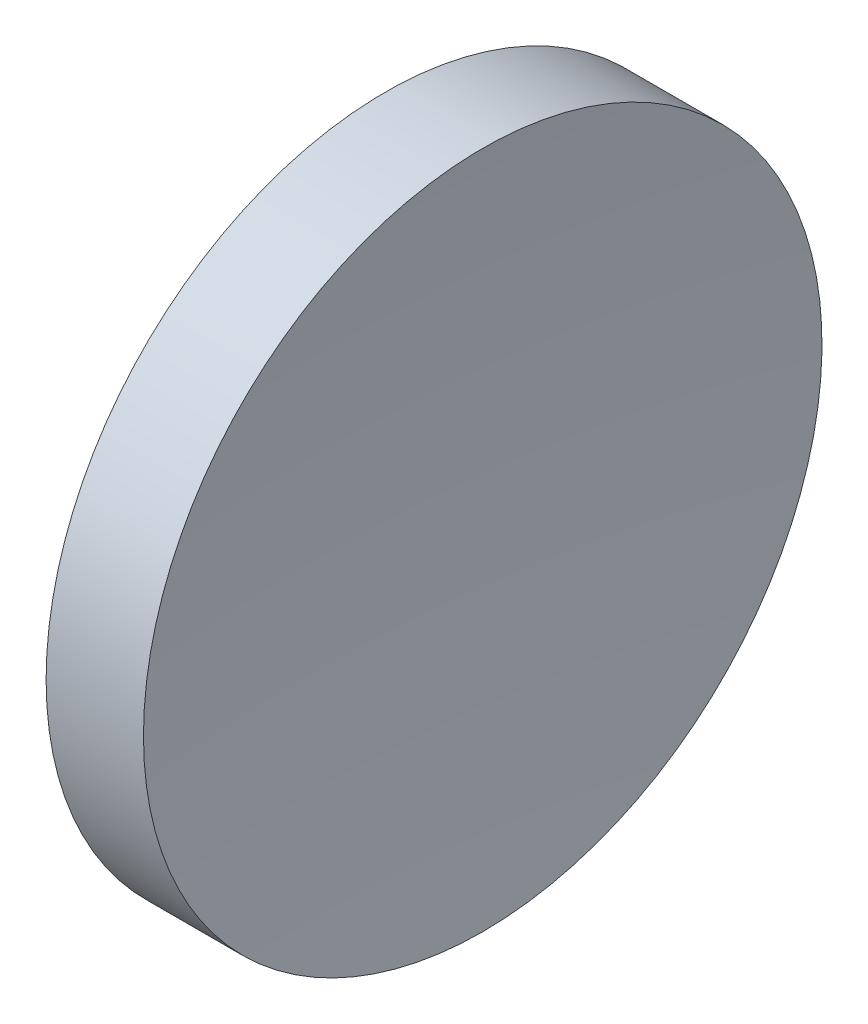
ISO-10303-21;
HEADER;
FILE_DESCRIPTION(('STEP AP214'),'2;1');
FILE_NAME('part.step','',(''),(''),'','','');
FILE_SCHEMA(('AUTOMOTIVE_DESIGN { 1 0 10303 214 1 1 1 1 }'));
ENDSEC;
DATA;
#1=APPLICATION_CONTEXT('core data for automotive mechanical design processes');
#2=APPLICATION_PROTOCOL_DEFINITION('international standard','automotive_design',2000,#1);
#3=PRODUCT_CONTEXT('',#1,'mechanical');
#4=PRODUCT('Part','Part','',(#3));
#5=PRODUCT_RELATED_PRODUCT_CATEGORY('part','',(#4));
#6=PRODUCT_DEFINITION_FORMATION('','',#4);
#7=PRODUCT_DEFINITION_CONTEXT('part definition',#1,'design');
#8=PRODUCT_DEFINITION('design','',#6,#7);
#9=PRODUCT_DEFINITION_SHAPE('','',#8);
#10=(LENGTH_UNIT() NAMED_UNIT(*) SI_UNIT(.MILLI.,.METRE.));
#11=(NAMED_UNIT(*) PLANE_ANGLE_UNIT() SI_UNIT($,.RADIAN.));
#12=(NAMED_UNIT(*) SI_UNIT($,.STERADIAN.) SOLID_ANGLE_UNIT());
#13=UNCERTAINTY_MEASURE_WITH_UNIT(LENGTH_MEASURE(1.E-05),#10,'distance_accuracy_value','');
#14=(GEOMETRIC_REPRESENTATION_CONTEXT(3) GLOBAL_UNCERTAINTY_ASSIGNED_CONTEXT((#13)) GLOBAL_UNIT_ASSIGNED_CONTEXT((#10,
#11,#12)) REPRESENTATION_CONTEXT('',''));
#15=CARTESIAN_POINT('',(0.,0.,0.));
#16=DIRECTION('',(0.,0.,1.));
#17=DIRECTION('',(1.,0.,0.));
#18=AXIS2_PLACEMENT_3D('',#15,#16,#17);
#19=CARTESIAN_POINT('',(639.199611900208,138.756042246745,0.));
#20=DIRECTION('',(-1.,0.,0.));
#21=DIRECTION('',(0.,-1.,0.));
#22=AXIS2_PLACEMENT_3D('',#19,#20,#21);
#23=SPHERICAL_SURFACE('',#22,400.);
#24=CARTESIAN_POINT('',(240.961303848359,138.756042246745,0.));
#25=DIRECTION('',(-1.,0.,0.));
#26=DIRECTION('',(0.,0.,1.));
#27=AXIS2_PLACEMENT_3D('',#24,#25,#26);
#28=CIRCLE('',#27,37.5);
#29=CARTESIAN_POINT('',(240.961303848359,138.756042246745,37.5));
#30=VERTEX_POINT('',#29);
#31=EDGE_CURVE('E10',#30,#30,#28,.T.);
#32=ORIENTED_EDGE('',*,*,#31,.F.);
#33=EDGE_LOOP('',(#32));
#34=FACE_BOUND('',#33,.T.);
#35=ADVANCED_FACE('F35',(#34),#23,.F.);
#36=CARTESIAN_POINT('',(217.97028600433,138.756042246745,0.));
#37=DIRECTION('',(-1.,0.,0.));
#38=DIRECTION('',(0.,0.,1.));
#39=AXIS2_PLACEMENT_3D('',#36,#37,#38);
#40=CYLINDRICAL_SURFACE('',#39,37.5);
#41=CARTESIAN_POINT('',(230.199611905266,138.756042246745,0.));
#42=DIRECTION('',(-1.,0.,0.));
#43=DIRECTION('',(0.,0.,1.));
#44=AXIS2_PLACEMENT_3D('',#41,#42,#43);
#45=CIRCLE('',#44,37.5);
#46=CARTESIAN_POINT('',(230.199611905266,138.756042246745,37.5));
#47=VERTEX_POINT('',#46);
#48=EDGE_CURVE('E41',#47,#47,#45,.T.);
#49=ORIENTED_EDGE('',*,*,#48,.F.);
#50=EDGE_LOOP('',(#49));
#51=FACE_BOUND('',#50,.T.);
#52=ORIENTED_EDGE('',*,*,#31,.T.);
#53=EDGE_LOOP('',(#52));
#54=FACE_BOUND('',#53,.T.);
#55=ADVANCED_FACE('F49',(#51,#54),#40,.T.);
#56=CARTESIAN_POINT('',(230.199611905266,138.756042246745,0.));
#57=DIRECTION('',(1.,0.,0.));
#58=DIRECTION('',(0.,0.,-1.));
#59=AXIS2_PLACEMENT_3D('',#56,#57,#58);
#60=PLANE('',#59);
#61=ORIENTED_EDGE('',*,*,#48,.T.);
#62=EDGE_LOOP('',(#61));
#63=FACE_BOUND('',#62,.T.);
#64=ADVANCED_FACE('F47',(#63),#60,.F.);
#65=CLOSED_SHELL('',(#35,#55,#64));
#66=MANIFOLD_SOLID_BREP('B2',#65);
#67=ADVANCED_BREP_SHAPE_REPRESENTATION('',(#18,#66),#14);
#68=SHAPE_DEFINITION_REPRESENTATION(#9,#67);
ENDSEC;
END-ISO-10303-21;
